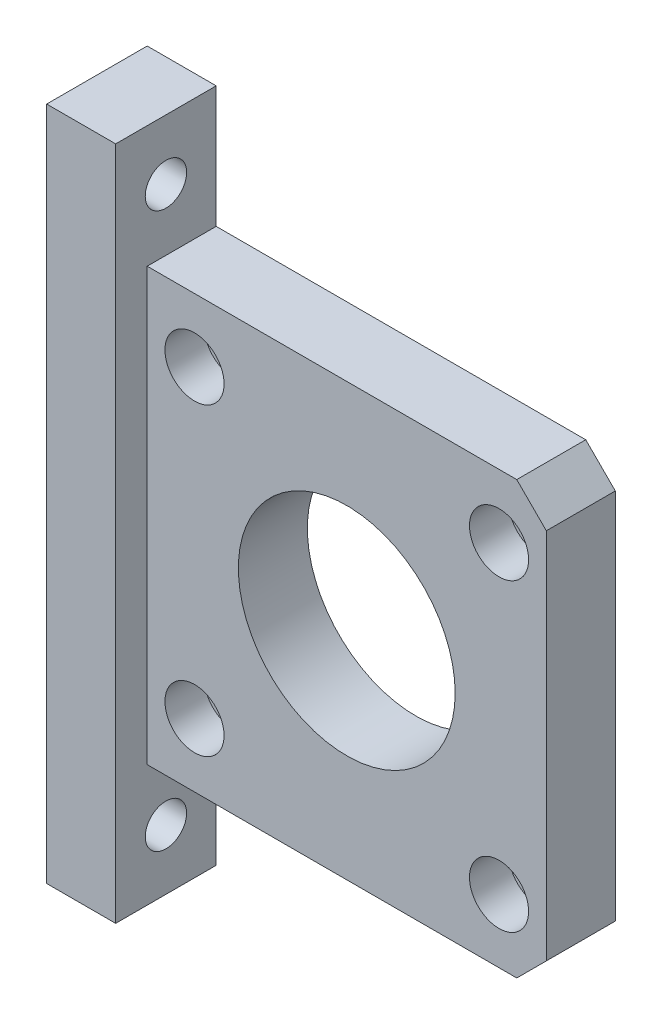
ISO-10303-21;
HEADER;
FILE_DESCRIPTION(('STEP AP214'),'2;1');
FILE_NAME('part.step','',(''),(''),'','','');
FILE_SCHEMA(('AUTOMOTIVE_DESIGN { 1 0 10303 214 1 1 1 1 }'));
ENDSEC;
DATA;
#1=APPLICATION_CONTEXT('core data for automotive mechanical design processes');
#2=APPLICATION_PROTOCOL_DEFINITION('international standard','automotive_design',2000,#1);
#3=PRODUCT_CONTEXT('',#1,'mechanical');
#4=PRODUCT('Part','Part','',(#3));
#5=PRODUCT_RELATED_PRODUCT_CATEGORY('part','',(#4));
#6=PRODUCT_DEFINITION_FORMATION('','',#4);
#7=PRODUCT_DEFINITION_CONTEXT('part definition',#1,'design');
#8=PRODUCT_DEFINITION('design','',#6,#7);
#9=PRODUCT_DEFINITION_SHAPE('','',#8);
#10=(LENGTH_UNIT() NAMED_UNIT(*) SI_UNIT(.MILLI.,.METRE.));
#11=(NAMED_UNIT(*) PLANE_ANGLE_UNIT() SI_UNIT($,.RADIAN.));
#12=(NAMED_UNIT(*) SI_UNIT($,.STERADIAN.) SOLID_ANGLE_UNIT());
#13=UNCERTAINTY_MEASURE_WITH_UNIT(LENGTH_MEASURE(1.E-05),#10,'distance_accuracy_value','');
#14=(GEOMETRIC_REPRESENTATION_CONTEXT(3) GLOBAL_UNCERTAINTY_ASSIGNED_CONTEXT((#13)) GLOBAL_UNIT_ASSIGNED_CONTEXT((#10,
#11,#12)) REPRESENTATION_CONTEXT('',''));
#15=CARTESIAN_POINT('',(0.,0.,0.));
#16=DIRECTION('',(0.,0.,1.));
#17=DIRECTION('',(1.,0.,0.));
#18=AXIS2_PLACEMENT_3D('',#15,#16,#17);
#19=CARTESIAN_POINT('',(15.4502831689261,15.4502831689261,7.));
#20=DIRECTION('',(0.,0.,-1.));
#21=DIRECTION('',(-1.,0.,0.));
#22=AXIS2_PLACEMENT_3D('',#19,#20,#21);
#23=CYLINDRICAL_SURFACE('',#22,1.75);
#24=CARTESIAN_POINT('',(15.4502831689261,15.4502831689261,0.));
#25=DIRECTION('',(0.,0.,1.));
#26=DIRECTION('',(1.,0.,0.));
#27=AXIS2_PLACEMENT_3D('',#24,#25,#26);
#28=CIRCLE('',#27,1.75);
#29=CARTESIAN_POINT('',(17.2002831689261,15.4502831689261,0.));
#30=VERTEX_POINT('',#29);
#31=EDGE_CURVE('E162',#30,#30,#28,.T.);
#32=ORIENTED_EDGE('',*,*,#31,.F.);
#33=EDGE_LOOP('',(#32));
#34=FACE_BOUND('',#33,.T.);
#35=CARTESIAN_POINT('',(15.4502831689261,15.4502831689261,3.));
#36=DIRECTION('',(0.,0.,1.));
#37=DIRECTION('',(1.,0.,0.));
#38=AXIS2_PLACEMENT_3D('',#35,#36,#37);
#39=CIRCLE('',#38,1.75);
#40=CARTESIAN_POINT('',(17.2002831689261,15.4502831689261,3.));
#41=VERTEX_POINT('',#40);
#42=EDGE_CURVE('E37',#41,#41,#39,.T.);
#43=ORIENTED_EDGE('',*,*,#42,.T.);
#44=EDGE_LOOP('',(#43));
#45=FACE_BOUND('',#44,.T.);
#46=ADVANCED_FACE('F33',(#34,#45),#23,.F.);
#47=CARTESIAN_POINT('',(15.4502831689268,-15.4502831689261,7.));
#48=DIRECTION('',(0.,0.,-1.));
#49=DIRECTION('',(-1.,0.,0.));
#50=AXIS2_PLACEMENT_3D('',#47,#48,#49);
#51=CYLINDRICAL_SURFACE('',#50,1.75);
#52=CARTESIAN_POINT('',(15.4502831689268,-15.4502831689261,0.));
#53=DIRECTION('',(0.,0.,1.));
#54=DIRECTION('',(1.,0.,0.));
#55=AXIS2_PLACEMENT_3D('',#52,#53,#54);
#56=CIRCLE('',#55,1.75);
#57=CARTESIAN_POINT('',(17.2002831689268,-15.4502831689261,0.));
#58=VERTEX_POINT('',#57);
#59=EDGE_CURVE('E154',#58,#58,#56,.T.);
#60=ORIENTED_EDGE('',*,*,#59,.F.);
#61=EDGE_LOOP('',(#60));
#62=FACE_BOUND('',#61,.T.);
#63=CARTESIAN_POINT('',(15.4502831689268,-15.4502831689261,3.));
#64=DIRECTION('',(0.,0.,1.));
#65=DIRECTION('',(1.,0.,0.));
#66=AXIS2_PLACEMENT_3D('',#63,#64,#65);
#67=CIRCLE('',#66,1.75);
#68=CARTESIAN_POINT('',(17.2002831689268,-15.4502831689261,3.));
#69=VERTEX_POINT('',#68);
#70=EDGE_CURVE('E140',#69,#69,#67,.T.);
#71=ORIENTED_EDGE('',*,*,#70,.T.);
#72=EDGE_LOOP('',(#71));
#73=FACE_BOUND('',#72,.T.);
#74=ADVANCED_FACE('F270',(#62,#73),#51,.F.);
#75=CARTESIAN_POINT('',(-15.4502831689254,-15.4502831689268,7.));
#76=DIRECTION('',(0.,0.,-1.));
#77=DIRECTION('',(-1.,0.,0.));
#78=AXIS2_PLACEMENT_3D('',#75,#76,#77);
#79=CYLINDRICAL_SURFACE('',#78,1.75000000000014);
#80=CARTESIAN_POINT('',(-15.4502831689254,-15.4502831689268,0.));
#81=DIRECTION('',(0.,0.,1.));
#82=DIRECTION('',(1.,0.,0.));
#83=AXIS2_PLACEMENT_3D('',#80,#81,#82);
#84=CIRCLE('',#83,1.75000000000014);
#85=CARTESIAN_POINT('',(-13.7002831689252,-15.4502831689268,0.));
#86=VERTEX_POINT('',#85);
#87=EDGE_CURVE('E149',#86,#86,#84,.T.);
#88=ORIENTED_EDGE('',*,*,#87,.F.);
#89=EDGE_LOOP('',(#88));
#90=FACE_BOUND('',#89,.T.);
#91=CARTESIAN_POINT('',(-15.4502831689254,-15.4502831689268,3.));
#92=DIRECTION('',(0.,0.,1.));
#93=DIRECTION('',(1.,0.,0.));
#94=AXIS2_PLACEMENT_3D('',#91,#92,#93);
#95=CIRCLE('',#94,1.75000000000014);
#96=CARTESIAN_POINT('',(-13.7002831689252,-15.4502831689268,3.));
#97=VERTEX_POINT('',#96);
#98=EDGE_CURVE('E137',#97,#97,#95,.T.);
#99=ORIENTED_EDGE('',*,*,#98,.T.);
#100=EDGE_LOOP('',(#99));
#101=FACE_BOUND('',#100,.T.);
#102=ADVANCED_FACE('F263',(#90,#101),#79,.F.);
#103=CARTESIAN_POINT('',(-15.4502831689261,15.4502831689254,7.));
#104=DIRECTION('',(0.,0.,-1.));
#105=DIRECTION('',(-1.,0.,0.));
#106=AXIS2_PLACEMENT_3D('',#103,#104,#105);
#107=CYLINDRICAL_SURFACE('',#106,1.75);
#108=CARTESIAN_POINT('',(-15.4502831689261,15.4502831689254,0.));
#109=DIRECTION('',(0.,0.,1.));
#110=DIRECTION('',(1.,0.,0.));
#111=AXIS2_PLACEMENT_3D('',#108,#109,#110);
#112=CIRCLE('',#111,1.75);
#113=CARTESIAN_POINT('',(-13.7002831689261,15.4502831689254,0.));
#114=VERTEX_POINT('',#113);
#115=EDGE_CURVE('E145',#114,#114,#112,.T.);
#116=ORIENTED_EDGE('',*,*,#115,.F.);
#117=EDGE_LOOP('',(#116));
#118=FACE_BOUND('',#117,.T.);
#119=CARTESIAN_POINT('',(-15.4502831689261,15.4502831689254,3.));
#120=DIRECTION('',(0.,0.,1.));
#121=DIRECTION('',(1.,0.,0.));
#122=AXIS2_PLACEMENT_3D('',#119,#120,#121);
#123=CIRCLE('',#122,1.75);
#124=CARTESIAN_POINT('',(-13.7002831689261,15.4502831689254,3.));
#125=VERTEX_POINT('',#124);
#126=EDGE_CURVE('E134',#125,#125,#123,.T.);
#127=ORIENTED_EDGE('',*,*,#126,.T.);
#128=EDGE_LOOP('',(#127));
#129=FACE_BOUND('',#128,.T.);
#130=ADVANCED_FACE('F254',(#118,#129),#107,.F.);
#131=CARTESIAN_POINT('',(0.,0.,7.));
#132=DIRECTION('',(0.,0.,-1.));
#133=DIRECTION('',(-1.,0.,0.));
#134=AXIS2_PLACEMENT_3D('',#131,#132,#133);
#135=PLANE('',#134);
#136=CARTESIAN_POINT('',(-15.4502831689261,15.4502831689252,7.));
#137=DIRECTION('',(0.,0.,1.));
#138=DIRECTION('',(1.,0.,0.));
#139=AXIS2_PLACEMENT_3D('',#136,#137,#138);
#140=CIRCLE('',#139,3.00000000000095);
#141=CARTESIAN_POINT('',(-12.4502831689251,15.4502831689252,7.));
#142=VERTEX_POINT('',#141);
#143=EDGE_CURVE('E221',#142,#142,#140,.T.);
#144=ORIENTED_EDGE('',*,*,#143,.F.);
#145=EDGE_LOOP('',(#144));
#146=FACE_BOUND('',#145,.T.);
#147=CARTESIAN_POINT('',(-15.4502831689252,-15.4502831689269,7.));
#148=DIRECTION('',(0.,0.,1.));
#149=DIRECTION('',(1.,0.,0.));
#150=AXIS2_PLACEMENT_3D('',#147,#148,#149);
#151=CIRCLE('',#150,3.00000000000065);
#152=CARTESIAN_POINT('',(-12.4502831689245,-15.4502831689269,7.));
#153=VERTEX_POINT('',#152);
#154=EDGE_CURVE('E238',#153,#153,#151,.T.);
#155=ORIENTED_EDGE('',*,*,#154,.F.);
#156=EDGE_LOOP('',(#155));
#157=FACE_BOUND('',#156,.T.);
#158=CARTESIAN_POINT('',(15.4502831689269,-15.4502831689261,7.));
#159=DIRECTION('',(0.,0.,1.));
#160=DIRECTION('',(1.,0.,0.));
#161=AXIS2_PLACEMENT_3D('',#158,#159,#160);
#162=CIRCLE('',#161,2.99999999999978);
#163=CARTESIAN_POINT('',(18.4502831689267,-15.4502831689261,7.));
#164=VERTEX_POINT('',#163);
#165=EDGE_CURVE('E232',#164,#164,#162,.T.);
#166=ORIENTED_EDGE('',*,*,#165,.F.);
#167=EDGE_LOOP('',(#166));
#168=FACE_BOUND('',#167,.T.);
#169=CARTESIAN_POINT('',(15.4502831689261,15.4502831689261,7.));
#170=DIRECTION('',(0.,0.,1.));
#171=DIRECTION('',(1.,0.,0.));
#172=AXIS2_PLACEMENT_3D('',#169,#170,#171);
#173=CIRCLE('',#172,3.);
#174=CARTESIAN_POINT('',(18.4502831689261,15.4502831689261,7.));
#175=VERTEX_POINT('',#174);
#176=EDGE_CURVE('E157',#175,#175,#173,.T.);
#177=ORIENTED_EDGE('',*,*,#176,.F.);
#178=EDGE_LOOP('',(#177));
#179=FACE_BOUND('',#178,.T.);
#180=DIRECTION('',(0.,-1.,0.));
#181=VECTOR('',#180,1.);
#182=CARTESIAN_POINT('',(-20.25,-21.9,7.));
#183=LINE('',#182,#181);
#184=CARTESIAN_POINT('',(-20.25,21.9,7.));
#185=VERTEX_POINT('',#184);
#186=CARTESIAN_POINT('',(-20.25,-21.9,7.));
#187=VERTEX_POINT('',#186);
#188=EDGE_CURVE('E127',#185,#187,#183,.T.);
#189=ORIENTED_EDGE('',*,*,#188,.T.);
#190=DIRECTION('',(1.,0.,0.));
#191=VECTOR('',#190,1.);
#192=CARTESIAN_POINT('',(-20.25,-21.9,7.));
#193=LINE('',#192,#191);
#194=CARTESIAN_POINT('',(17.25,-21.9,7.));
#195=VERTEX_POINT('',#194);
#196=EDGE_CURVE('E88',#187,#195,#193,.T.);
#197=ORIENTED_EDGE('',*,*,#196,.T.);
#198=DIRECTION('',(0.707106781186548,0.707106781186548,0.));
#199=VECTOR('',#198,1.);
#200=CARTESIAN_POINT('',(17.25,-21.9,7.));
#201=LINE('',#200,#199);
#202=CARTESIAN_POINT('',(20.25,-18.9,7.));
#203=VERTEX_POINT('',#202);
#204=EDGE_CURVE('E103',#195,#203,#201,.T.);
#205=ORIENTED_EDGE('',*,*,#204,.T.);
#206=DIRECTION('',(0.,1.,0.));
#207=VECTOR('',#206,1.);
#208=CARTESIAN_POINT('',(20.25,-18.9,7.));
#209=LINE('',#208,#207);
#210=CARTESIAN_POINT('',(20.25,18.9,7.));
#211=VERTEX_POINT('',#210);
#212=EDGE_CURVE('E97',#203,#211,#209,.T.);
#213=ORIENTED_EDGE('',*,*,#212,.T.);
#214=DIRECTION('',(-0.707106781186548,0.707106781186548,0.));
#215=VECTOR('',#214,1.);
#216=CARTESIAN_POINT('',(17.25,21.9,7.));
#217=LINE('',#216,#215);
#218=CARTESIAN_POINT('',(17.25,21.9,7.));
#219=VERTEX_POINT('',#218);
#220=EDGE_CURVE('E101',#211,#219,#217,.T.);
#221=ORIENTED_EDGE('',*,*,#220,.T.);
#222=DIRECTION('',(-1.,0.,0.));
#223=VECTOR('',#222,1.);
#224=CARTESIAN_POINT('',(-20.25,21.9,7.));
#225=LINE('',#224,#223);
#226=EDGE_CURVE('E52',#219,#185,#225,.T.);
#227=ORIENTED_EDGE('',*,*,#226,.T.);
#228=EDGE_LOOP('',(#189,#197,#205,#213,#221,#227));
#229=FACE_BOUND('',#228,.T.);
#230=CARTESIAN_POINT('',(0.,0.,7.));
#231=DIRECTION('',(0.,0.,1.));
#232=DIRECTION('',(1.,0.,0.));
#233=AXIS2_PLACEMENT_3D('',#230,#231,#232);
#234=CIRCLE('',#233,11.);
#235=CARTESIAN_POINT('',(11.,0.,7.));
#236=VERTEX_POINT('',#235);
#237=EDGE_CURVE('E120',#236,#236,#234,.T.);
#238=ORIENTED_EDGE('',*,*,#237,.F.);
#239=EDGE_LOOP('',(#238));
#240=FACE_BOUND('',#239,.T.);
#241=ADVANCED_FACE('F98',(#146,#157,#168,#179,#229,#240),#135,.F.);
#242=CARTESIAN_POINT('',(0.,0.,0.));
#243=DIRECTION('',(0.,0.,-1.));
#244=DIRECTION('',(-1.,0.,0.));
#245=AXIS2_PLACEMENT_3D('',#242,#243,#244);
#246=PLANE('',#245);
#247=ORIENTED_EDGE('',*,*,#87,.T.);
#248=EDGE_LOOP('',(#247));
#249=FACE_BOUND('',#248,.T.);
#250=ORIENTED_EDGE('',*,*,#31,.T.);
#251=EDGE_LOOP('',(#250));
#252=FACE_BOUND('',#251,.T.);
#253=DIRECTION('',(1.,0.,0.));
#254=VECTOR('',#253,1.);
#255=CARTESIAN_POINT('',(-20.25,-21.9,0.));
#256=LINE('',#255,#254);
#257=CARTESIAN_POINT('',(-20.25,-21.9,0.));
#258=VERTEX_POINT('',#257);
#259=CARTESIAN_POINT('',(17.25,-21.9,0.));
#260=VERTEX_POINT('',#259);
#261=EDGE_CURVE('E117',#258,#260,#256,.T.);
#262=ORIENTED_EDGE('',*,*,#261,.F.);
#263=DIRECTION('',(0.,-1.,0.));
#264=VECTOR('',#263,1.);
#265=CARTESIAN_POINT('',(-20.25,34.25,0.));
#266=LINE('',#265,#264);
#267=CARTESIAN_POINT('',(-20.25,-34.25,0.));
#268=VERTEX_POINT('',#267);
#269=EDGE_CURVE('E194',#258,#268,#266,.T.);
#270=ORIENTED_EDGE('',*,*,#269,.T.);
#271=DIRECTION('',(-1.,0.,0.));
#272=VECTOR('',#271,1.);
#273=CARTESIAN_POINT('',(-20.25,-34.25,0.));
#274=LINE('',#273,#272);
#275=CARTESIAN_POINT('',(-27.25,-34.25,0.));
#276=VERTEX_POINT('',#275);
#277=EDGE_CURVE('E203',#268,#276,#274,.T.);
#278=ORIENTED_EDGE('',*,*,#277,.T.);
#279=DIRECTION('',(0.,1.,0.));
#280=VECTOR('',#279,1.);
#281=CARTESIAN_POINT('',(-27.25,34.25,0.));
#282=LINE('',#281,#280);
#283=CARTESIAN_POINT('',(-27.25,34.25,0.));
#284=VERTEX_POINT('',#283);
#285=EDGE_CURVE('E212',#276,#284,#282,.T.);
#286=ORIENTED_EDGE('',*,*,#285,.T.);
#287=DIRECTION('',(1.,0.,0.));
#288=VECTOR('',#287,1.);
#289=CARTESIAN_POINT('',(-20.25,34.25,0.));
#290=LINE('',#289,#288);
#291=CARTESIAN_POINT('',(-20.25,34.25,0.));
#292=VERTEX_POINT('',#291);
#293=EDGE_CURVE('E215',#284,#292,#290,.T.);
#294=ORIENTED_EDGE('',*,*,#293,.T.);
#295=CARTESIAN_POINT('',(-20.25,21.9,0.));
#296=VERTEX_POINT('',#295);
#297=EDGE_CURVE('E183',#292,#296,#266,.T.);
#298=ORIENTED_EDGE('',*,*,#297,.T.);
#299=DIRECTION('',(-1.,0.,0.));
#300=VECTOR('',#299,1.);
#301=CARTESIAN_POINT('',(-20.25,21.9,0.));
#302=LINE('',#301,#300);
#303=CARTESIAN_POINT('',(17.25,21.9,0.));
#304=VERTEX_POINT('',#303);
#305=EDGE_CURVE('E124',#304,#296,#302,.T.);
#306=ORIENTED_EDGE('',*,*,#305,.F.);
#307=DIRECTION('',(-0.707106781186548,0.707106781186548,0.));
#308=VECTOR('',#307,1.);
#309=CARTESIAN_POINT('',(17.25,21.9,0.));
#310=LINE('',#309,#308);
#311=CARTESIAN_POINT('',(20.25,18.9,0.));
#312=VERTEX_POINT('',#311);
#313=EDGE_CURVE('E80',#312,#304,#310,.T.);
#314=ORIENTED_EDGE('',*,*,#313,.F.);
#315=DIRECTION('',(0.,1.,0.));
#316=VECTOR('',#315,1.);
#317=CARTESIAN_POINT('',(20.25,-18.9,0.));
#318=LINE('',#317,#316);
#319=CARTESIAN_POINT('',(20.25,-18.9,0.));
#320=VERTEX_POINT('',#319);
#321=EDGE_CURVE('E73',#320,#312,#318,.T.);
#322=ORIENTED_EDGE('',*,*,#321,.F.);
#323=DIRECTION('',(0.707106781186548,0.707106781186548,0.));
#324=VECTOR('',#323,1.);
#325=CARTESIAN_POINT('',(17.25,-21.9,0.));
#326=LINE('',#325,#324);
#327=EDGE_CURVE('E119',#260,#320,#326,.T.);
#328=ORIENTED_EDGE('',*,*,#327,.F.);
#329=EDGE_LOOP('',(#262,#270,#278,#286,#294,#298,#306,#314,#322,#328));
#330=FACE_BOUND('',#329,.T.);
#331=CARTESIAN_POINT('',(0.,0.,0.));
#332=DIRECTION('',(0.,0.,1.));
#333=DIRECTION('',(1.,0.,0.));
#334=AXIS2_PLACEMENT_3D('',#331,#332,#333);
#335=CIRCLE('',#334,11.);
#336=CARTESIAN_POINT('',(11.,0.,0.));
#337=VERTEX_POINT('',#336);
#338=EDGE_CURVE('E165',#337,#337,#335,.T.);
#339=ORIENTED_EDGE('',*,*,#338,.T.);
#340=EDGE_LOOP('',(#339));
#341=FACE_BOUND('',#340,.T.);
#342=ORIENTED_EDGE('',*,*,#59,.T.);
#343=EDGE_LOOP('',(#342));
#344=FACE_BOUND('',#343,.T.);
#345=ORIENTED_EDGE('',*,*,#115,.T.);
#346=EDGE_LOOP('',(#345));
#347=FACE_BOUND('',#346,.T.);
#348=ADVANCED_FACE('F177',(#249,#252,#330,#341,#344,#347),#246,.T.);
#349=CARTESIAN_POINT('',(-20.25,-21.9,7.));
#350=DIRECTION('',(0.,1.,0.));
#351=DIRECTION('',(0.,0.,1.));
#352=AXIS2_PLACEMENT_3D('',#349,#350,#351);
#353=PLANE('',#352);
#354=ORIENTED_EDGE('',*,*,#261,.T.);
#355=DIRECTION('',(0.,0.,-1.));
#356=VECTOR('',#355,1.);
#357=CARTESIAN_POINT('',(17.25,-21.9,7.));
#358=LINE('',#357,#356);
#359=EDGE_CURVE('E43',#195,#260,#358,.T.);
#360=ORIENTED_EDGE('',*,*,#359,.F.);
#361=ORIENTED_EDGE('',*,*,#196,.F.);
#362=DIRECTION('',(0.,0.,-1.));
#363=VECTOR('',#362,1.);
#364=CARTESIAN_POINT('',(-20.25,-21.9,7.));
#365=LINE('',#364,#363);
#366=EDGE_CURVE('E11',#187,#258,#365,.T.);
#367=ORIENTED_EDGE('',*,*,#366,.T.);
#368=EDGE_LOOP('',(#354,#360,#361,#367));
#369=FACE_BOUND('',#368,.T.);
#370=ADVANCED_FACE('F35',(#369),#353,.F.);
#371=CARTESIAN_POINT('',(17.25,-21.9,7.));
#372=DIRECTION('',(-0.707106781186547,0.707106781186547,0.));
#373=DIRECTION('',(-0.707106781186548,-0.707106781186548,0.));
#374=AXIS2_PLACEMENT_3D('',#371,#372,#373);
#375=PLANE('',#374);
#376=ORIENTED_EDGE('',*,*,#327,.T.);
#377=DIRECTION('',(0.,0.,-1.));
#378=VECTOR('',#377,1.);
#379=CARTESIAN_POINT('',(20.25,-18.9,7.));
#380=LINE('',#379,#378);
#381=EDGE_CURVE('E108',#203,#320,#380,.T.);
#382=ORIENTED_EDGE('',*,*,#381,.F.);
#383=ORIENTED_EDGE('',*,*,#204,.F.);
#384=ORIENTED_EDGE('',*,*,#359,.T.);
#385=EDGE_LOOP('',(#376,#382,#383,#384));
#386=FACE_BOUND('',#385,.T.);
#387=ADVANCED_FACE('F175',(#386),#375,.F.);
#388=CARTESIAN_POINT('',(20.25,-18.9,7.));
#389=DIRECTION('',(-1.,0.,0.));
#390=DIRECTION('',(0.,0.,1.));
#391=AXIS2_PLACEMENT_3D('',#388,#389,#390);
#392=PLANE('',#391);
#393=ORIENTED_EDGE('',*,*,#321,.T.);
#394=DIRECTION('',(0.,0.,-1.));
#395=VECTOR('',#394,1.);
#396=CARTESIAN_POINT('',(20.25,18.9,7.));
#397=LINE('',#396,#395);
#398=EDGE_CURVE('E106',#211,#312,#397,.T.);
#399=ORIENTED_EDGE('',*,*,#398,.F.);
#400=ORIENTED_EDGE('',*,*,#212,.F.);
#401=ORIENTED_EDGE('',*,*,#381,.T.);
#402=EDGE_LOOP('',(#393,#399,#400,#401));
#403=FACE_BOUND('',#402,.T.);
#404=ADVANCED_FACE('F107',(#403),#392,.F.);
#405=CARTESIAN_POINT('',(17.25,21.9,7.));
#406=DIRECTION('',(-0.707106781186547,-0.707106781186547,0.));
#407=DIRECTION('',(0.707106781186548,-0.707106781186548,0.));
#408=AXIS2_PLACEMENT_3D('',#405,#406,#407);
#409=PLANE('',#408);
#410=ORIENTED_EDGE('',*,*,#313,.T.);
#411=DIRECTION('',(0.,0.,-1.));
#412=VECTOR('',#411,1.);
#413=CARTESIAN_POINT('',(17.25,21.9,7.));
#414=LINE('',#413,#412);
#415=EDGE_CURVE('E109',#219,#304,#414,.T.);
#416=ORIENTED_EDGE('',*,*,#415,.F.);
#417=ORIENTED_EDGE('',*,*,#220,.F.);
#418=ORIENTED_EDGE('',*,*,#398,.T.);
#419=EDGE_LOOP('',(#410,#416,#417,#418));
#420=FACE_BOUND('',#419,.T.);
#421=ADVANCED_FACE('F111',(#420),#409,.F.);
#422=CARTESIAN_POINT('',(-20.25,21.9,7.));
#423=DIRECTION('',(0.,-1.,0.));
#424=DIRECTION('',(0.,0.,-1.));
#425=AXIS2_PLACEMENT_3D('',#422,#423,#424);
#426=PLANE('',#425);
#427=ORIENTED_EDGE('',*,*,#305,.T.);
#428=DIRECTION('',(0.,0.,-1.));
#429=VECTOR('',#428,1.);
#430=CARTESIAN_POINT('',(-20.25,21.9,7.));
#431=LINE('',#430,#429);
#432=EDGE_CURVE('E113',#185,#296,#431,.T.);
#433=ORIENTED_EDGE('',*,*,#432,.F.);
#434=ORIENTED_EDGE('',*,*,#226,.F.);
#435=ORIENTED_EDGE('',*,*,#415,.T.);
#436=EDGE_LOOP('',(#427,#433,#434,#435));
#437=FACE_BOUND('',#436,.T.);
#438=ADVANCED_FACE('F185',(#437),#426,.F.);
#439=CARTESIAN_POINT('',(0.,0.,7.));
#440=DIRECTION('',(0.,0.,-1.));
#441=DIRECTION('',(-1.,0.,0.));
#442=AXIS2_PLACEMENT_3D('',#439,#440,#441);
#443=CYLINDRICAL_SURFACE('',#442,11.);
#444=ORIENTED_EDGE('',*,*,#237,.T.);
#445=EDGE_LOOP('',(#444));
#446=FACE_BOUND('',#445,.T.);
#447=ORIENTED_EDGE('',*,*,#338,.F.);
#448=EDGE_LOOP('',(#447));
#449=FACE_BOUND('',#448,.T.);
#450=ADVANCED_FACE('F280',(#446,#449),#443,.F.);
#451=CARTESIAN_POINT('',(-15.4502831689261,15.4502831689252,3.));
#452=DIRECTION('',(0.,0.,1.));
#453=DIRECTION('',(1.,0.,0.));
#454=AXIS2_PLACEMENT_3D('',#451,#452,#453);
#455=CYLINDRICAL_SURFACE('',#454,3.00000000000095);
#456=CARTESIAN_POINT('',(-15.4502831689261,15.4502831689252,3.));
#457=DIRECTION('',(0.,0.,1.));
#458=DIRECTION('',(1.,0.,0.));
#459=AXIS2_PLACEMENT_3D('',#456,#457,#458);
#460=CIRCLE('',#459,3.00000000000095);
#461=CARTESIAN_POINT('',(-12.4502831689251,15.4502831689252,3.));
#462=VERTEX_POINT('',#461);
#463=EDGE_CURVE('E241',#462,#462,#460,.T.);
#464=ORIENTED_EDGE('',*,*,#463,.F.);
#465=EDGE_LOOP('',(#464));
#466=FACE_BOUND('',#465,.T.);
#467=ORIENTED_EDGE('',*,*,#143,.T.);
#468=EDGE_LOOP('',(#467));
#469=FACE_BOUND('',#468,.T.);
#470=ADVANCED_FACE('F282',(#466,#469),#455,.F.);
#471=CARTESIAN_POINT('',(-15.4502831689261,15.4502831689252,3.));
#472=DIRECTION('',(0.,0.,1.));
#473=DIRECTION('',(1.,0.,0.));
#474=AXIS2_PLACEMENT_3D('',#471,#472,#473);
#475=PLANE('',#474);
#476=ORIENTED_EDGE('',*,*,#126,.F.);
#477=EDGE_LOOP('',(#476));
#478=FACE_BOUND('',#477,.T.);
#479=ORIENTED_EDGE('',*,*,#463,.T.);
#480=EDGE_LOOP('',(#479));
#481=FACE_BOUND('',#480,.T.);
#482=ADVANCED_FACE('F288',(#478,#481),#475,.T.);
#483=CARTESIAN_POINT('',(-15.4502831689252,-15.4502831689269,3.));
#484=DIRECTION('',(0.,0.,1.));
#485=DIRECTION('',(1.,0.,0.));
#486=AXIS2_PLACEMENT_3D('',#483,#484,#485);
#487=CYLINDRICAL_SURFACE('',#486,3.00000000000065);
#488=CARTESIAN_POINT('',(-15.4502831689252,-15.4502831689269,3.));
#489=DIRECTION('',(0.,0.,1.));
#490=DIRECTION('',(1.,0.,0.));
#491=AXIS2_PLACEMENT_3D('',#488,#489,#490);
#492=CIRCLE('',#491,3.00000000000065);
#493=CARTESIAN_POINT('',(-12.4502831689245,-15.4502831689269,3.));
#494=VERTEX_POINT('',#493);
#495=EDGE_CURVE('E235',#494,#494,#492,.T.);
#496=ORIENTED_EDGE('',*,*,#495,.F.);
#497=EDGE_LOOP('',(#496));
#498=FACE_BOUND('',#497,.T.);
#499=ORIENTED_EDGE('',*,*,#154,.T.);
#500=EDGE_LOOP('',(#499));
#501=FACE_BOUND('',#500,.T.);
#502=ADVANCED_FACE('F369',(#498,#501),#487,.F.);
#503=CARTESIAN_POINT('',(-15.4502831689252,-15.4502831689269,3.));
#504=DIRECTION('',(0.,0.,1.));
#505=DIRECTION('',(1.,0.,0.));
#506=AXIS2_PLACEMENT_3D('',#503,#504,#505);
#507=PLANE('',#506);
#508=ORIENTED_EDGE('',*,*,#98,.F.);
#509=EDGE_LOOP('',(#508));
#510=FACE_BOUND('',#509,.T.);
#511=ORIENTED_EDGE('',*,*,#495,.T.);
#512=EDGE_LOOP('',(#511));
#513=FACE_BOUND('',#512,.T.);
#514=ADVANCED_FACE('F359',(#510,#513),#507,.T.);
#515=CARTESIAN_POINT('',(15.4502831689269,-15.4502831689261,3.));
#516=DIRECTION('',(0.,0.,1.));
#517=DIRECTION('',(1.,0.,0.));
#518=AXIS2_PLACEMENT_3D('',#515,#516,#517);
#519=CYLINDRICAL_SURFACE('',#518,2.99999999999978);
#520=CARTESIAN_POINT('',(15.4502831689269,-15.4502831689261,3.));
#521=DIRECTION('',(0.,0.,1.));
#522=DIRECTION('',(1.,0.,0.));
#523=AXIS2_PLACEMENT_3D('',#520,#521,#522);
#524=CIRCLE('',#523,2.99999999999978);
#525=CARTESIAN_POINT('',(18.4502831689267,-15.4502831689261,3.));
#526=VERTEX_POINT('',#525);
#527=EDGE_CURVE('E229',#526,#526,#524,.T.);
#528=ORIENTED_EDGE('',*,*,#527,.F.);
#529=EDGE_LOOP('',(#528));
#530=FACE_BOUND('',#529,.T.);
#531=ORIENTED_EDGE('',*,*,#165,.T.);
#532=EDGE_LOOP('',(#531));
#533=FACE_BOUND('',#532,.T.);
#534=ADVANCED_FACE('F349',(#530,#533),#519,.F.);
#535=CARTESIAN_POINT('',(15.4502831689269,-15.4502831689261,3.));
#536=DIRECTION('',(0.,0.,1.));
#537=DIRECTION('',(1.,0.,0.));
#538=AXIS2_PLACEMENT_3D('',#535,#536,#537);
#539=PLANE('',#538);
#540=ORIENTED_EDGE('',*,*,#70,.F.);
#541=EDGE_LOOP('',(#540));
#542=FACE_BOUND('',#541,.T.);
#543=ORIENTED_EDGE('',*,*,#527,.T.);
#544=EDGE_LOOP('',(#543));
#545=FACE_BOUND('',#544,.T.);
#546=ADVANCED_FACE('F339',(#542,#545),#539,.T.);
#547=CARTESIAN_POINT('',(15.4502831689261,15.4502831689261,3.));
#548=DIRECTION('',(0.,0.,1.));
#549=DIRECTION('',(1.,0.,0.));
#550=AXIS2_PLACEMENT_3D('',#547,#548,#549);
#551=CYLINDRICAL_SURFACE('',#550,3.);
#552=CARTESIAN_POINT('',(15.4502831689261,15.4502831689261,3.));
#553=DIRECTION('',(0.,0.,1.));
#554=DIRECTION('',(1.,0.,0.));
#555=AXIS2_PLACEMENT_3D('',#552,#553,#554);
#556=CIRCLE('',#555,3.);
#557=CARTESIAN_POINT('',(18.4502831689261,15.4502831689261,3.));
#558=VERTEX_POINT('',#557);
#559=EDGE_CURVE('E138',#558,#558,#556,.T.);
#560=ORIENTED_EDGE('',*,*,#559,.F.);
#561=EDGE_LOOP('',(#560));
#562=FACE_BOUND('',#561,.T.);
#563=ORIENTED_EDGE('',*,*,#176,.T.);
#564=EDGE_LOOP('',(#563));
#565=FACE_BOUND('',#564,.T.);
#566=ADVANCED_FACE('F251',(#562,#565),#551,.F.);
#567=CARTESIAN_POINT('',(15.4502831689261,15.4502831689261,3.));
#568=DIRECTION('',(0.,0.,1.));
#569=DIRECTION('',(1.,0.,0.));
#570=AXIS2_PLACEMENT_3D('',#567,#568,#569);
#571=PLANE('',#570);
#572=ORIENTED_EDGE('',*,*,#42,.F.);
#573=EDGE_LOOP('',(#572));
#574=FACE_BOUND('',#573,.T.);
#575=ORIENTED_EDGE('',*,*,#559,.T.);
#576=EDGE_LOOP('',(#575));
#577=FACE_BOUND('',#576,.T.);
#578=ADVANCED_FACE('F325',(#574,#577),#571,.T.);
#579=CARTESIAN_POINT('',(-20.25,34.25,10.2));
#580=DIRECTION('',(1.,0.,0.));
#581=DIRECTION('',(0.,0.,-1.));
#582=AXIS2_PLACEMENT_3D('',#579,#580,#581);
#583=PLANE('',#582);
#584=CARTESIAN_POINT('',(-20.25,28.15,5.1));
#585=DIRECTION('',(-1.,0.,0.));
#586=DIRECTION('',(0.,0.,1.));
#587=AXIS2_PLACEMENT_3D('',#584,#585,#586);
#588=CIRCLE('',#587,2.1);
#589=CARTESIAN_POINT('',(-20.25,28.15,7.2));
#590=VERTEX_POINT('',#589);
#591=EDGE_CURVE('E201',#590,#590,#588,.T.);
#592=ORIENTED_EDGE('',*,*,#591,.T.);
#593=EDGE_LOOP('',(#592));
#594=FACE_BOUND('',#593,.T.);
#595=CARTESIAN_POINT('',(-20.25,-28.15,5.1));
#596=DIRECTION('',(-1.,0.,0.));
#597=DIRECTION('',(0.,0.,-1.));
#598=AXIS2_PLACEMENT_3D('',#595,#596,#597);
#599=CIRCLE('',#598,2.1);
#600=CARTESIAN_POINT('',(-20.25,-28.15,3.));
#601=VERTEX_POINT('',#600);
#602=EDGE_CURVE('E521',#601,#601,#599,.T.);
#603=ORIENTED_EDGE('',*,*,#602,.T.);
#604=EDGE_LOOP('',(#603));
#605=FACE_BOUND('',#604,.T.);
#606=ORIENTED_EDGE('',*,*,#366,.F.);
#607=ORIENTED_EDGE('',*,*,#188,.F.);
#608=ORIENTED_EDGE('',*,*,#432,.T.);
#609=ORIENTED_EDGE('',*,*,#297,.F.);
#610=DIRECTION('',(0.,0.,-1.));
#611=VECTOR('',#610,1.);
#612=CARTESIAN_POINT('',(-20.25,34.25,10.2));
#613=LINE('',#612,#611);
#614=CARTESIAN_POINT('',(-20.25,34.25,10.2));
#615=VERTEX_POINT('',#614);
#616=EDGE_CURVE('E218',#615,#292,#613,.T.);
#617=ORIENTED_EDGE('',*,*,#616,.F.);
#618=DIRECTION('',(0.,-1.,0.));
#619=VECTOR('',#618,1.);
#620=CARTESIAN_POINT('',(-20.25,34.25,10.2));
#621=LINE('',#620,#619);
#622=CARTESIAN_POINT('',(-20.25,-34.25,10.2));
#623=VERTEX_POINT('',#622);
#624=EDGE_CURVE('E217',#615,#623,#621,.T.);
#625=ORIENTED_EDGE('',*,*,#624,.T.);
#626=DIRECTION('',(0.,0.,-1.));
#627=VECTOR('',#626,1.);
#628=CARTESIAN_POINT('',(-20.25,-34.25,10.2));
#629=LINE('',#628,#627);
#630=EDGE_CURVE('E198',#623,#268,#629,.T.);
#631=ORIENTED_EDGE('',*,*,#630,.T.);
#632=ORIENTED_EDGE('',*,*,#269,.F.);
#633=EDGE_LOOP('',(#606,#607,#608,#609,#617,#625,#631,#632));
#634=FACE_BOUND('',#633,.T.);
#635=ADVANCED_FACE('F188',(#594,#605,#634),#583,.T.);
#636=CARTESIAN_POINT('',(-20.25,34.25,10.2));
#637=DIRECTION('',(0.,1.,0.));
#638=DIRECTION('',(0.,0.,1.));
#639=AXIS2_PLACEMENT_3D('',#636,#637,#638);
#640=PLANE('',#639);
#641=ORIENTED_EDGE('',*,*,#293,.F.);
#642=DIRECTION('',(0.,0.,-1.));
#643=VECTOR('',#642,1.);
#644=CARTESIAN_POINT('',(-27.25,34.25,10.2));
#645=LINE('',#644,#643);
#646=CARTESIAN_POINT('',(-27.25,34.25,10.2));
#647=VERTEX_POINT('',#646);
#648=EDGE_CURVE('E222',#647,#284,#645,.T.);
#649=ORIENTED_EDGE('',*,*,#648,.F.);
#650=DIRECTION('',(1.,0.,0.));
#651=VECTOR('',#650,1.);
#652=CARTESIAN_POINT('',(-20.25,34.25,10.2));
#653=LINE('',#652,#651);
#654=EDGE_CURVE('E209',#647,#615,#653,.T.);
#655=ORIENTED_EDGE('',*,*,#654,.T.);
#656=ORIENTED_EDGE('',*,*,#616,.T.);
#657=EDGE_LOOP('',(#641,#649,#655,#656));
#658=FACE_BOUND('',#657,.T.);
#659=ADVANCED_FACE('F451',(#658),#640,.T.);
#660=CARTESIAN_POINT('',(-27.25,34.25,10.2));
#661=DIRECTION('',(-1.,0.,0.));
#662=DIRECTION('',(0.,0.,1.));
#663=AXIS2_PLACEMENT_3D('',#660,#661,#662);
#664=PLANE('',#663);
#665=CARTESIAN_POINT('',(-27.25,28.15,5.1));
#666=DIRECTION('',(-1.,0.,0.));
#667=DIRECTION('',(0.,0.,1.));
#668=AXIS2_PLACEMENT_3D('',#665,#666,#667);
#669=CIRCLE('',#668,2.1);
#670=CARTESIAN_POINT('',(-27.25,28.15,7.2));
#671=VERTEX_POINT('',#670);
#672=EDGE_CURVE('E205',#671,#671,#669,.T.);
#673=ORIENTED_EDGE('',*,*,#672,.F.);
#674=EDGE_LOOP('',(#673));
#675=FACE_BOUND('',#674,.T.);
#676=CARTESIAN_POINT('',(-27.25,-28.15,5.1));
#677=DIRECTION('',(-1.,0.,0.));
#678=DIRECTION('',(0.,0.,-1.));
#679=AXIS2_PLACEMENT_3D('',#676,#677,#678);
#680=CIRCLE('',#679,2.1);
#681=CARTESIAN_POINT('',(-27.25,-28.15,3.));
#682=VERTEX_POINT('',#681);
#683=EDGE_CURVE('E524',#682,#682,#680,.T.);
#684=ORIENTED_EDGE('',*,*,#683,.F.);
#685=EDGE_LOOP('',(#684));
#686=FACE_BOUND('',#685,.T.);
#687=ORIENTED_EDGE('',*,*,#285,.F.);
#688=DIRECTION('',(0.,0.,-1.));
#689=VECTOR('',#688,1.);
#690=CARTESIAN_POINT('',(-27.25,-34.25,10.2));
#691=LINE('',#690,#689);
#692=CARTESIAN_POINT('',(-27.25,-34.25,10.2));
#693=VERTEX_POINT('',#692);
#694=EDGE_CURVE('E225',#693,#276,#691,.T.);
#695=ORIENTED_EDGE('',*,*,#694,.F.);
#696=DIRECTION('',(0.,1.,0.));
#697=VECTOR('',#696,1.);
#698=CARTESIAN_POINT('',(-27.25,34.25,10.2));
#699=LINE('',#698,#697);
#700=EDGE_CURVE('E532',#693,#647,#699,.T.);
#701=ORIENTED_EDGE('',*,*,#700,.T.);
#702=ORIENTED_EDGE('',*,*,#648,.T.);
#703=EDGE_LOOP('',(#687,#695,#701,#702));
#704=FACE_BOUND('',#703,.T.);
#705=ADVANCED_FACE('F456',(#675,#686,#704),#664,.T.);
#706=CARTESIAN_POINT('',(-20.25,-34.25,10.2));
#707=DIRECTION('',(0.,-1.,0.));
#708=DIRECTION('',(0.,0.,-1.));
#709=AXIS2_PLACEMENT_3D('',#706,#707,#708);
#710=PLANE('',#709);
#711=ORIENTED_EDGE('',*,*,#277,.F.);
#712=ORIENTED_EDGE('',*,*,#630,.F.);
#713=DIRECTION('',(-1.,0.,0.));
#714=VECTOR('',#713,1.);
#715=CARTESIAN_POINT('',(-20.25,-34.25,10.2));
#716=LINE('',#715,#714);
#717=EDGE_CURVE('E530',#623,#693,#716,.T.);
#718=ORIENTED_EDGE('',*,*,#717,.T.);
#719=ORIENTED_EDGE('',*,*,#694,.T.);
#720=EDGE_LOOP('',(#711,#712,#718,#719));
#721=FACE_BOUND('',#720,.T.);
#722=ADVANCED_FACE('F464',(#721),#710,.T.);
#723=CARTESIAN_POINT('',(0.,0.,10.2));
#724=DIRECTION('',(0.,0.,-1.));
#725=DIRECTION('',(-1.,0.,0.));
#726=AXIS2_PLACEMENT_3D('',#723,#724,#725);
#727=PLANE('',#726);
#728=ORIENTED_EDGE('',*,*,#624,.F.);
#729=ORIENTED_EDGE('',*,*,#654,.F.);
#730=ORIENTED_EDGE('',*,*,#700,.F.);
#731=ORIENTED_EDGE('',*,*,#717,.F.);
#732=EDGE_LOOP('',(#728,#729,#730,#731));
#733=FACE_BOUND('',#732,.T.);
#734=ADVANCED_FACE('F469',(#733),#727,.F.);
#735=CARTESIAN_POINT('',(-20.25,-28.15,5.1));
#736=DIRECTION('',(-1.,0.,0.));
#737=DIRECTION('',(0.,0.,1.));
#738=AXIS2_PLACEMENT_3D('',#735,#736,#737);
#739=CYLINDRICAL_SURFACE('',#738,2.1);
#740=ORIENTED_EDGE('',*,*,#602,.F.);
#741=EDGE_LOOP('',(#740));
#742=FACE_BOUND('',#741,.T.);
#743=ORIENTED_EDGE('',*,*,#683,.T.);
#744=EDGE_LOOP('',(#743));
#745=FACE_BOUND('',#744,.T.);
#746=ADVANCED_FACE('F479',(#742,#745),#739,.F.);
#747=CARTESIAN_POINT('',(-20.25,28.15,5.1));
#748=DIRECTION('',(-1.,0.,0.));
#749=DIRECTION('',(0.,0.,1.));
#750=AXIS2_PLACEMENT_3D('',#747,#748,#749);
#751=CYLINDRICAL_SURFACE('',#750,2.1);
#752=ORIENTED_EDGE('',*,*,#591,.F.);
#753=EDGE_LOOP('',(#752));
#754=FACE_BOUND('',#753,.T.);
#755=ORIENTED_EDGE('',*,*,#672,.T.);
#756=EDGE_LOOP('',(#755));
#757=FACE_BOUND('',#756,.T.);
#758=ADVANCED_FACE('F503',(#754,#757),#751,.F.);
#759=CLOSED_SHELL('',(#46,#74,#102,#130,#241,#348,#370,#387,#404,#421,#438,#450,#470,#482,#502,
#514,#534,#546,#566,#578,#635,#659,#705,#722,#734,#746,#758));
#760=MANIFOLD_SOLID_BREP('B2',#759);
#761=ADVANCED_BREP_SHAPE_REPRESENTATION('',(#18,#760),#14);
#762=SHAPE_DEFINITION_REPRESENTATION(#9,#761);
ENDSEC;
END-ISO-10303-21;
